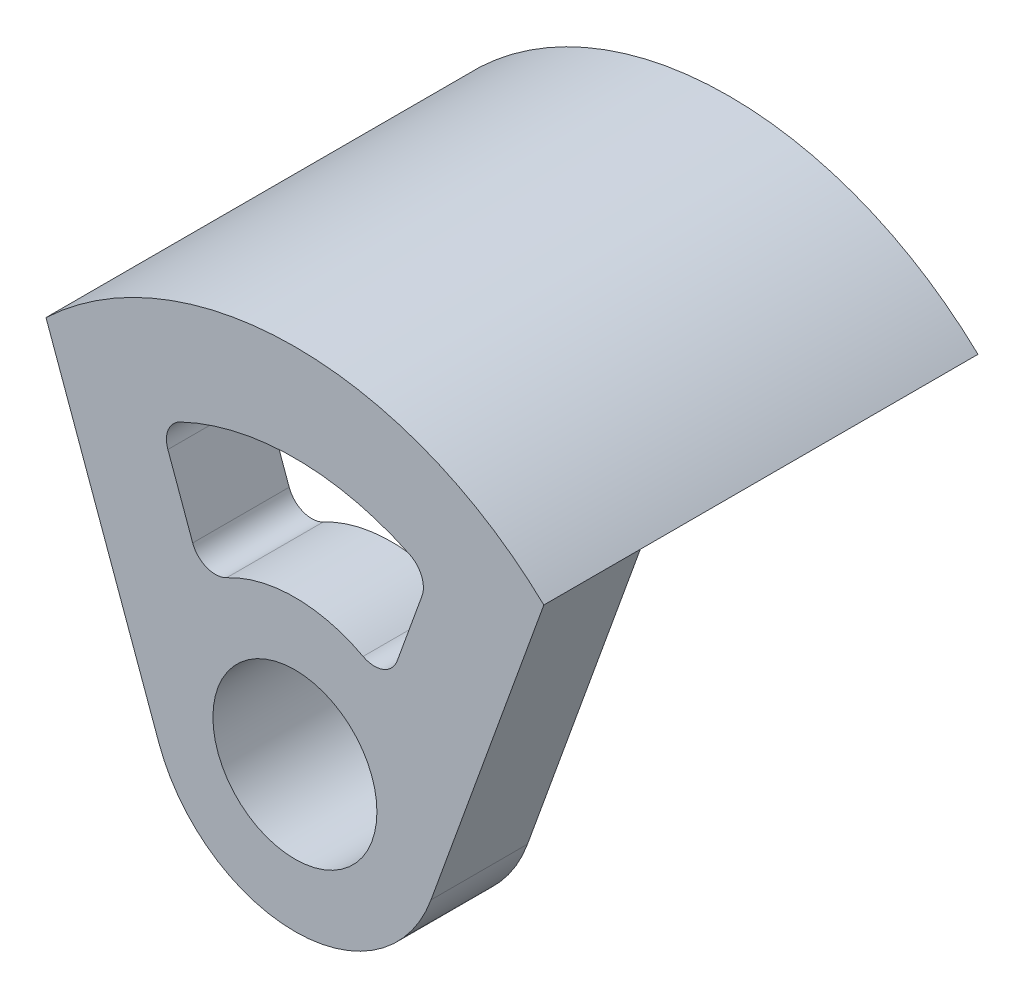
ISO-10303-21;
HEADER;
FILE_DESCRIPTION(('STEP AP214'),'2;1');
FILE_NAME('part.step','',(''),(''),'','','');
FILE_SCHEMA(('AUTOMOTIVE_DESIGN { 1 0 10303 214 1 1 1 1 }'));
ENDSEC;
DATA;
#1=APPLICATION_CONTEXT('core data for automotive mechanical design processes');
#2=APPLICATION_PROTOCOL_DEFINITION('international standard','automotive_design',2000,#1);
#3=PRODUCT_CONTEXT('',#1,'mechanical');
#4=PRODUCT('Part','Part','',(#3));
#5=PRODUCT_RELATED_PRODUCT_CATEGORY('part','',(#4));
#6=PRODUCT_DEFINITION_FORMATION('','',#4);
#7=PRODUCT_DEFINITION_CONTEXT('part definition',#1,'design');
#8=PRODUCT_DEFINITION('design','',#6,#7);
#9=PRODUCT_DEFINITION_SHAPE('','',#8);
#10=(LENGTH_UNIT() NAMED_UNIT(*) SI_UNIT(.MILLI.,.METRE.));
#11=(NAMED_UNIT(*) PLANE_ANGLE_UNIT() SI_UNIT($,.RADIAN.));
#12=(NAMED_UNIT(*) SI_UNIT($,.STERADIAN.) SOLID_ANGLE_UNIT());
#13=UNCERTAINTY_MEASURE_WITH_UNIT(LENGTH_MEASURE(1.E-05),#10,'distance_accuracy_value','');
#14=(GEOMETRIC_REPRESENTATION_CONTEXT(3) GLOBAL_UNCERTAINTY_ASSIGNED_CONTEXT((#13)) GLOBAL_UNIT_ASSIGNED_CONTEXT((#10,
#11,#12)) REPRESENTATION_CONTEXT('',''));
#15=CARTESIAN_POINT('',(0.,0.,0.));
#16=DIRECTION('',(0.,0.,1.));
#17=DIRECTION('',(1.,0.,0.));
#18=AXIS2_PLACEMENT_3D('',#15,#16,#17);
#19=CARTESIAN_POINT('',(0.,0.,-2.));
#20=DIRECTION('',(0.,0.,-1.));
#21=DIRECTION('',(-1.,0.,0.));
#22=AXIS2_PLACEMENT_3D('',#19,#20,#21);
#23=PLANE('',#22);
#24=DIRECTION('',(0.707106781186548,0.707106781186547,0.));
#25=VECTOR('',#24,1.);
#26=CARTESIAN_POINT('',(-0.141421356237321,0.141421356237321,-2.));
#27=LINE('',#26,#25);
#28=CARTESIAN_POINT('',(4.59408284078331,4.87692555325795,-2.));
#29=VERTEX_POINT('',#28);
#30=CARTESIAN_POINT('',(5.15999354923839,5.44283626171302,-2.));
#31=VERTEX_POINT('',#30);
#32=EDGE_CURVE('E211',#29,#31,#27,.T.);
#33=ORIENTED_EDGE('',*,*,#32,.F.);
#34=CARTESIAN_POINT('',(0.,0.,-2.));
#35=DIRECTION('',(0.,0.,-1.));
#36=DIRECTION('',(-1.,0.,0.));
#37=AXIS2_PLACEMENT_3D('',#34,#35,#36);
#38=CIRCLE('',#37,6.7);
#39=CARTESIAN_POINT('',(-4.59408284078335,4.87692555325792,-2.));
#40=VERTEX_POINT('',#39);
#41=EDGE_CURVE('E210',#29,#40,#38,.F.);
#42=ORIENTED_EDGE('',*,*,#41,.T.);
#43=DIRECTION('',(-0.707106781186551,0.707106781186544,0.));
#44=VECTOR('',#43,1.);
#45=CARTESIAN_POINT('',(0.141421356237305,0.141421356237306,-2.));
#46=LINE('',#45,#44);
#47=CARTESIAN_POINT('',(-5.15999354923843,5.44283626171299,-2.));
#48=VERTEX_POINT('',#47);
#49=EDGE_CURVE('E215',#40,#48,#46,.T.);
#50=ORIENTED_EDGE('',*,*,#49,.T.);
#51=CARTESIAN_POINT('',(0.,0.,-2.));
#52=DIRECTION('',(0.,0.,-1.));
#53=DIRECTION('',(-1.,0.,0.));
#54=AXIS2_PLACEMENT_3D('',#51,#52,#53);
#55=CIRCLE('',#54,7.5);
#56=EDGE_CURVE('E218',#31,#48,#55,.F.);
#57=ORIENTED_EDGE('',*,*,#56,.F.);
#58=EDGE_LOOP('',(#33,#42,#50,#57));
#59=FACE_BOUND('',#58,.T.);
#60=ADVANCED_FACE('F35',(#59),#23,.T.);
#61=CARTESIAN_POINT('',(-0.141421356237321,0.141421356237321,-12.6481290969766));
#62=DIRECTION('',(0.707106781186547,-0.707106781186548,0.));
#63=DIRECTION('',(0.707106781186548,0.707106781186547,0.));
#64=AXIS2_PLACEMENT_3D('',#61,#62,#63);
#65=PLANE('',#64);
#66=DIRECTION('',(0.,0.,1.));
#67=VECTOR('',#66,1.);
#68=CARTESIAN_POINT('',(4.59408284078331,4.87692555325795,-12.6481290969766));
#69=LINE('',#68,#67);
#70=CARTESIAN_POINT('',(4.59408284078331,4.87692555325795,5.));
#71=VERTEX_POINT('',#70);
#72=EDGE_CURVE('E225',#29,#71,#69,.T.);
#73=ORIENTED_EDGE('',*,*,#72,.F.);
#74=ORIENTED_EDGE('',*,*,#32,.T.);
#75=DIRECTION('',(0.,0.,1.));
#76=VECTOR('',#75,1.);
#77=CARTESIAN_POINT('',(5.15999354923839,5.44283626171302,-12.6481290969766));
#78=LINE('',#77,#76);
#79=CARTESIAN_POINT('',(5.15999354923839,5.44283626171302,5.));
#80=VERTEX_POINT('',#79);
#81=EDGE_CURVE('E214',#31,#80,#78,.T.);
#82=ORIENTED_EDGE('',*,*,#81,.T.);
#83=DIRECTION('',(0.707106781186548,0.707106781186547,0.));
#84=VECTOR('',#83,1.);
#85=CARTESIAN_POINT('',(-0.141421356237321,0.141421356237321,5.));
#86=LINE('',#85,#84);
#87=EDGE_CURVE('E205',#71,#80,#86,.T.);
#88=ORIENTED_EDGE('',*,*,#87,.F.);
#89=EDGE_LOOP('',(#73,#74,#82,#88));
#90=FACE_BOUND('',#89,.T.);
#91=ADVANCED_FACE('F324',(#90),#65,.T.);
#92=CARTESIAN_POINT('',(0.,0.,-12.6481290969766));
#93=DIRECTION('',(0.,0.,1.));
#94=DIRECTION('',(1.,0.,0.));
#95=AXIS2_PLACEMENT_3D('',#92,#93,#94);
#96=CYLINDRICAL_SURFACE('',#95,7.5);
#97=ORIENTED_EDGE('',*,*,#81,.F.);
#98=ORIENTED_EDGE('',*,*,#56,.T.);
#99=DIRECTION('',(0.,0.,1.));
#100=VECTOR('',#99,1.);
#101=CARTESIAN_POINT('',(-5.15999354923843,5.44283626171299,-12.6481290969766));
#102=LINE('',#101,#100);
#103=CARTESIAN_POINT('',(-5.15999354923843,5.44283626171299,5.));
#104=VERTEX_POINT('',#103);
#105=EDGE_CURVE('E221',#48,#104,#102,.T.);
#106=ORIENTED_EDGE('',*,*,#105,.T.);
#107=DIRECTION('',(0.,0.,-1.));
#108=VECTOR('',#107,1.);
#109=CARTESIAN_POINT('',(-5.15999354923843,5.44283626171299,7.));
#110=LINE('',#109,#108);
#111=CARTESIAN_POINT('',(-5.15999354923843,5.44283626171299,7.));
#112=VERTEX_POINT('',#111);
#113=EDGE_CURVE('E154',#112,#104,#110,.T.);
#114=ORIENTED_EDGE('',*,*,#113,.F.);
#115=CARTESIAN_POINT('',(0.,0.,7.));
#116=DIRECTION('',(0.,0.,1.));
#117=DIRECTION('',(1.,0.,0.));
#118=AXIS2_PLACEMENT_3D('',#115,#116,#117);
#119=CIRCLE('',#118,7.5);
#120=CARTESIAN_POINT('',(5.15999354923839,5.44283626171302,7.));
#121=VERTEX_POINT('',#120);
#122=EDGE_CURVE('E158',#121,#112,#119,.T.);
#123=ORIENTED_EDGE('',*,*,#122,.F.);
#124=DIRECTION('',(0.,0.,-1.));
#125=VECTOR('',#124,1.);
#126=CARTESIAN_POINT('',(5.15999354923839,5.44283626171302,7.));
#127=LINE('',#126,#125);
#128=EDGE_CURVE('E143',#121,#80,#127,.T.);
#129=ORIENTED_EDGE('',*,*,#128,.T.);
#130=EDGE_LOOP('',(#97,#98,#106,#114,#123,#129));
#131=FACE_BOUND('',#130,.T.);
#132=ADVANCED_FACE('F159',(#131),#96,.T.);
#133=CARTESIAN_POINT('',(0.141421356237305,0.141421356237306,-12.6481290969766));
#134=DIRECTION('',(0.707106781186544,0.707106781186551,0.));
#135=DIRECTION('',(-0.707106781186551,0.707106781186544,0.));
#136=AXIS2_PLACEMENT_3D('',#133,#134,#135);
#137=PLANE('',#136);
#138=ORIENTED_EDGE('',*,*,#49,.F.);
#139=DIRECTION('',(0.,0.,1.));
#140=VECTOR('',#139,1.);
#141=CARTESIAN_POINT('',(-4.59408284078335,4.87692555325791,-12.6481290969766));
#142=LINE('',#141,#140);
#143=CARTESIAN_POINT('',(-4.59408284078335,4.87692555325791,5.));
#144=VERTEX_POINT('',#143);
#145=EDGE_CURVE('E222',#40,#144,#142,.T.);
#146=ORIENTED_EDGE('',*,*,#145,.T.);
#147=DIRECTION('',(-0.707106781186551,0.707106781186544,0.));
#148=VECTOR('',#147,1.);
#149=CARTESIAN_POINT('',(0.141421356237305,0.141421356237306,5.));
#150=LINE('',#149,#148);
#151=EDGE_CURVE('E207',#144,#104,#150,.T.);
#152=ORIENTED_EDGE('',*,*,#151,.T.);
#153=ORIENTED_EDGE('',*,*,#105,.F.);
#154=EDGE_LOOP('',(#138,#146,#152,#153));
#155=FACE_BOUND('',#154,.T.);
#156=ADVANCED_FACE('F465',(#155),#137,.F.);
#157=CARTESIAN_POINT('',(0.,0.,-12.6481290969766));
#158=DIRECTION('',(0.,0.,1.));
#159=DIRECTION('',(1.,0.,0.));
#160=AXIS2_PLACEMENT_3D('',#157,#158,#159);
#161=CYLINDRICAL_SURFACE('',#160,6.7);
#162=ORIENTED_EDGE('',*,*,#41,.F.);
#163=ORIENTED_EDGE('',*,*,#72,.T.);
#164=CARTESIAN_POINT('',(0.,0.,5.));
#165=DIRECTION('',(0.,0.,1.));
#166=DIRECTION('',(1.,0.,0.));
#167=AXIS2_PLACEMENT_3D('',#164,#165,#166);
#168=CIRCLE('',#167,6.7);
#169=EDGE_CURVE('E153',#71,#144,#168,.T.);
#170=ORIENTED_EDGE('',*,*,#169,.T.);
#171=ORIENTED_EDGE('',*,*,#145,.F.);
#172=EDGE_LOOP('',(#162,#163,#170,#171));
#173=FACE_BOUND('',#172,.T.);
#174=ADVANCED_FACE('F419',(#173),#161,.F.);
#175=CARTESIAN_POINT('',(0.,0.,5.));
#176=DIRECTION('',(0.,0.,1.));
#177=DIRECTION('',(1.,0.,0.));
#178=AXIS2_PLACEMENT_3D('',#175,#176,#177);
#179=PLANE('',#178);
#180=CARTESIAN_POINT('',(0.,0.,5.));
#181=DIRECTION('',(0.,0.,1.));
#182=DIRECTION('',(1.,0.,0.));
#183=AXIS2_PLACEMENT_3D('',#180,#181,#182);
#184=CIRCLE('',#183,2.7);
#185=CARTESIAN_POINT('',(2.7,0.,5.));
#186=VERTEX_POINT('',#185);
#187=EDGE_CURVE('E230',#186,#186,#184,.T.);
#188=ORIENTED_EDGE('',*,*,#187,.T.);
#189=EDGE_LOOP('',(#188));
#190=FACE_BOUND('',#189,.T.);
#191=DIRECTION('',(-0.340277026705139,-0.940325233680725,0.));
#192=VECTOR('',#191,1.);
#193=CARTESIAN_POINT('',(0.940325233680727,-0.340277026705139,5.));
#194=LINE('',#193,#192);
#195=CARTESIAN_POINT('',(2.63318206721876,4.3377819448282,5.));
#196=VERTEX_POINT('',#195);
#197=CARTESIAN_POINT('',(2.11907943148427,2.91710513404305,5.));
#198=VERTEX_POINT('',#197);
#199=EDGE_CURVE('E180',#196,#198,#194,.T.);
#200=ORIENTED_EDGE('',*,*,#199,.F.);
#201=CARTESIAN_POINT('',(2.1630194503784,4.50792045818077,5.));
#202=DIRECTION('',(0.,0.,1.));
#203=DIRECTION('',(1.,0.,0.));
#204=AXIS2_PLACEMENT_3D('',#201,#202,#203);
#205=CIRCLE('',#204,0.5);
#206=CARTESIAN_POINT('',(2.37932139541624,4.95871250399885,5.));
#207=VERTEX_POINT('',#206);
#208=EDGE_CURVE('E260',#196,#207,#205,.T.);
#209=ORIENTED_EDGE('',*,*,#208,.T.);
#210=CARTESIAN_POINT('',(0.,0.,5.));
#211=DIRECTION('',(0.,0.,1.));
#212=DIRECTION('',(1.,0.,0.));
#213=AXIS2_PLACEMENT_3D('',#210,#211,#212);
#214=CIRCLE('',#213,5.5);
#215=CARTESIAN_POINT('',(-2.37932139541627,4.95871250399883,5.));
#216=VERTEX_POINT('',#215);
#217=EDGE_CURVE('E191',#207,#216,#214,.T.);
#218=ORIENTED_EDGE('',*,*,#217,.T.);
#219=CARTESIAN_POINT('',(-2.16301945037843,4.50792045818076,5.));
#220=DIRECTION('',(0.,0.,1.));
#221=DIRECTION('',(1.,0.,0.));
#222=AXIS2_PLACEMENT_3D('',#219,#220,#221);
#223=CIRCLE('',#222,0.5);
#224=CARTESIAN_POINT('',(-2.63318206721879,4.33778194482819,5.));
#225=VERTEX_POINT('',#224);
#226=EDGE_CURVE('E43',#216,#225,#223,.T.);
#227=ORIENTED_EDGE('',*,*,#226,.T.);
#228=DIRECTION('',(0.340277026705145,-0.940325233680723,0.));
#229=VECTOR('',#228,1.);
#230=CARTESIAN_POINT('',(-0.940325233680723,-0.340277026705145,5.));
#231=LINE('',#230,#229);
#232=CARTESIAN_POINT('',(-2.11907943148429,2.91710513404303,5.));
#233=VERTEX_POINT('',#232);
#234=EDGE_CURVE('E187',#225,#233,#231,.T.);
#235=ORIENTED_EDGE('',*,*,#234,.T.);
#236=CARTESIAN_POINT('',(-1.64891681464393,3.08724364739561,5.));
#237=DIRECTION('',(0.,0.,1.));
#238=DIRECTION('',(1.,0.,0.));
#239=AXIS2_PLACEMENT_3D('',#236,#237,#238);
#240=CIRCLE('',#239,0.5);
#241=CARTESIAN_POINT('',(-1.4133572696948,2.6462088406248,5.));
#242=VERTEX_POINT('',#241);
#243=EDGE_CURVE('E256',#233,#242,#240,.T.);
#244=ORIENTED_EDGE('',*,*,#243,.T.);
#245=CARTESIAN_POINT('',(0.,0.,5.));
#246=DIRECTION('',(0.,0.,1.));
#247=DIRECTION('',(1.,0.,0.));
#248=AXIS2_PLACEMENT_3D('',#245,#246,#247);
#249=CIRCLE('',#248,3.);
#250=CARTESIAN_POINT('',(1.41335726969478,2.64620884062481,5.));
#251=VERTEX_POINT('',#250);
#252=EDGE_CURVE('E183',#251,#242,#249,.T.);
#253=ORIENTED_EDGE('',*,*,#252,.F.);
#254=CARTESIAN_POINT('',(1.64891681464391,3.08724364739562,5.));
#255=DIRECTION('',(0.,0.,1.));
#256=DIRECTION('',(1.,0.,0.));
#257=AXIS2_PLACEMENT_3D('',#254,#255,#256);
#258=CIRCLE('',#257,0.5);
#259=EDGE_CURVE('E252',#251,#198,#258,.T.);
#260=ORIENTED_EDGE('',*,*,#259,.T.);
#261=EDGE_LOOP('',(#200,#209,#218,#227,#235,#244,#253,#260));
#262=FACE_BOUND('',#261,.T.);
#263=ORIENTED_EDGE('',*,*,#169,.F.);
#264=ORIENTED_EDGE('',*,*,#87,.T.);
#265=DIRECTION('',(-0.340277026705139,-0.940325233680725,0.));
#266=VECTOR('',#265,1.);
#267=CARTESIAN_POINT('',(2.82097570104218,-1.02083108011542,5.));
#268=LINE('',#267,#266);
#269=CARTESIAN_POINT('',(2.82097570104218,-1.02083108011542,5.));
#270=VERTEX_POINT('',#269);
#271=EDGE_CURVE('E149',#80,#270,#268,.T.);
#272=ORIENTED_EDGE('',*,*,#271,.T.);
#273=CARTESIAN_POINT('',(-2.82097570104217,-1.02083108011544,5.));
#274=VERTEX_POINT('',#273);
#275=EDGE_CURVE('E188',#274,#270,#249,.T.);
#276=ORIENTED_EDGE('',*,*,#275,.F.);
#277=DIRECTION('',(0.340277026705146,-0.940325233680723,0.));
#278=VECTOR('',#277,1.);
#279=CARTESIAN_POINT('',(-2.82097570104217,-1.02083108011544,5.));
#280=LINE('',#279,#278);
#281=EDGE_CURVE('E195',#104,#274,#280,.T.);
#282=ORIENTED_EDGE('',*,*,#281,.F.);
#283=ORIENTED_EDGE('',*,*,#151,.F.);
#284=EDGE_LOOP('',(#263,#264,#272,#276,#282,#283));
#285=FACE_BOUND('',#284,.T.);
#286=ADVANCED_FACE('F266',(#190,#262,#285),#179,.F.);
#287=CARTESIAN_POINT('',(2.82097570104218,-1.02083108011542,7.));
#288=DIRECTION('',(0.940325233680725,-0.340277026705139,0.));
#289=DIRECTION('',(0.340277026705139,0.940325233680725,0.));
#290=AXIS2_PLACEMENT_3D('',#287,#288,#289);
#291=PLANE('',#290);
#292=ORIENTED_EDGE('',*,*,#271,.F.);
#293=ORIENTED_EDGE('',*,*,#128,.F.);
#294=DIRECTION('',(-0.340277026705139,-0.940325233680725,0.));
#295=VECTOR('',#294,1.);
#296=CARTESIAN_POINT('',(2.82097570104218,-1.02083108011542,7.));
#297=LINE('',#296,#295);
#298=CARTESIAN_POINT('',(2.82097570104218,-1.02083108011542,7.));
#299=VERTEX_POINT('',#298);
#300=EDGE_CURVE('E147',#121,#299,#297,.T.);
#301=ORIENTED_EDGE('',*,*,#300,.T.);
#302=DIRECTION('',(0.,0.,-1.));
#303=VECTOR('',#302,1.);
#304=CARTESIAN_POINT('',(2.82097570104218,-1.02083108011542,7.));
#305=LINE('',#304,#303);
#306=EDGE_CURVE('E179',#299,#270,#305,.T.);
#307=ORIENTED_EDGE('',*,*,#306,.T.);
#308=EDGE_LOOP('',(#292,#293,#301,#307));
#309=FACE_BOUND('',#308,.T.);
#310=ADVANCED_FACE('F145',(#309),#291,.T.);
#311=CARTESIAN_POINT('',(-2.82097570104217,-1.02083108011544,7.));
#312=DIRECTION('',(0.940325233680723,0.340277026705146,0.));
#313=DIRECTION('',(-0.340277026705146,0.940325233680723,0.));
#314=AXIS2_PLACEMENT_3D('',#311,#312,#313);
#315=PLANE('',#314);
#316=ORIENTED_EDGE('',*,*,#281,.T.);
#317=DIRECTION('',(0.,0.,-1.));
#318=VECTOR('',#317,1.);
#319=CARTESIAN_POINT('',(-2.82097570104217,-1.02083108011544,7.));
#320=LINE('',#319,#318);
#321=CARTESIAN_POINT('',(-2.82097570104217,-1.02083108011544,7.));
#322=VERTEX_POINT('',#321);
#323=EDGE_CURVE('E199',#322,#274,#320,.T.);
#324=ORIENTED_EDGE('',*,*,#323,.F.);
#325=DIRECTION('',(0.340277026705146,-0.940325233680723,0.));
#326=VECTOR('',#325,1.);
#327=CARTESIAN_POINT('',(-2.82097570104217,-1.02083108011544,7.));
#328=LINE('',#327,#326);
#329=EDGE_CURVE('E163',#112,#322,#328,.T.);
#330=ORIENTED_EDGE('',*,*,#329,.F.);
#331=ORIENTED_EDGE('',*,*,#113,.T.);
#332=EDGE_LOOP('',(#316,#324,#330,#331));
#333=FACE_BOUND('',#332,.T.);
#334=ADVANCED_FACE('F408',(#333),#315,.F.);
#335=CARTESIAN_POINT('',(0.940325233680727,-0.340277026705139,7.));
#336=DIRECTION('',(0.940325233680725,-0.340277026705139,0.));
#337=DIRECTION('',(0.340277026705139,0.940325233680725,0.));
#338=AXIS2_PLACEMENT_3D('',#335,#336,#337);
#339=PLANE('',#338);
#340=ORIENTED_EDGE('',*,*,#199,.T.);
#341=DIRECTION('',(0.,0.,1.));
#342=VECTOR('',#341,1.);
#343=CARTESIAN_POINT('',(2.11907943148427,2.91710513404305,7.));
#344=LINE('',#343,#342);
#345=CARTESIAN_POINT('',(2.11907943148427,2.91710513404305,7.));
#346=VERTEX_POINT('',#345);
#347=EDGE_CURVE('E241',#198,#346,#344,.T.);
#348=ORIENTED_EDGE('',*,*,#347,.T.);
#349=DIRECTION('',(-0.340277026705139,-0.940325233680725,0.));
#350=VECTOR('',#349,1.);
#351=CARTESIAN_POINT('',(0.940325233680727,-0.340277026705139,7.));
#352=LINE('',#351,#350);
#353=CARTESIAN_POINT('',(2.63318206721876,4.3377819448282,7.));
#354=VERTEX_POINT('',#353);
#355=EDGE_CURVE('E285',#354,#346,#352,.T.);
#356=ORIENTED_EDGE('',*,*,#355,.F.);
#357=DIRECTION('',(0.,0.,-1.));
#358=VECTOR('',#357,1.);
#359=CARTESIAN_POINT('',(2.63318206721876,4.3377819448282,7.));
#360=LINE('',#359,#358);
#361=EDGE_CURVE('E238',#354,#196,#360,.T.);
#362=ORIENTED_EDGE('',*,*,#361,.T.);
#363=EDGE_LOOP('',(#340,#348,#356,#362));
#364=FACE_BOUND('',#363,.T.);
#365=ADVANCED_FACE('F283',(#364),#339,.F.);
#366=CARTESIAN_POINT('',(0.,0.,7.));
#367=DIRECTION('',(0.,0.,-1.));
#368=DIRECTION('',(-1.,0.,0.));
#369=AXIS2_PLACEMENT_3D('',#366,#367,#368);
#370=CYLINDRICAL_SURFACE('',#369,3.);
#371=CARTESIAN_POINT('',(0.,0.,7.));
#372=DIRECTION('',(0.,0.,1.));
#373=DIRECTION('',(1.,0.,0.));
#374=AXIS2_PLACEMENT_3D('',#371,#372,#373);
#375=CIRCLE('',#374,3.);
#376=CARTESIAN_POINT('',(1.41335726969478,2.64620884062481,7.));
#377=VERTEX_POINT('',#376);
#378=CARTESIAN_POINT('',(-1.4133572696948,2.6462088406248,7.));
#379=VERTEX_POINT('',#378);
#380=EDGE_CURVE('E296',#377,#379,#375,.T.);
#381=ORIENTED_EDGE('',*,*,#380,.F.);
#382=DIRECTION('',(0.,0.,-1.));
#383=VECTOR('',#382,1.);
#384=CARTESIAN_POINT('',(1.41335726969478,2.64620884062481,7.));
#385=LINE('',#384,#383);
#386=EDGE_CURVE('E235',#377,#251,#385,.T.);
#387=ORIENTED_EDGE('',*,*,#386,.T.);
#388=ORIENTED_EDGE('',*,*,#252,.T.);
#389=DIRECTION('',(0.,0.,-1.));
#390=VECTOR('',#389,1.);
#391=CARTESIAN_POINT('',(-1.4133572696948,2.6462088406248,7.));
#392=LINE('',#391,#390);
#393=EDGE_CURVE('E233',#242,#379,#392,.F.);
#394=ORIENTED_EDGE('',*,*,#393,.T.);
#395=EDGE_LOOP('',(#381,#387,#388,#394));
#396=FACE_BOUND('',#395,.T.);
#397=ADVANCED_FACE('F293',(#396),#370,.T.);
#398=CARTESIAN_POINT('',(-0.940325233680723,-0.340277026705145,7.));
#399=DIRECTION('',(0.940325233680723,0.340277026705145,0.));
#400=DIRECTION('',(-0.340277026705145,0.940325233680723,0.));
#401=AXIS2_PLACEMENT_3D('',#398,#399,#400);
#402=PLANE('',#401);
#403=DIRECTION('',(0.340277026705145,-0.940325233680723,0.));
#404=VECTOR('',#403,1.);
#405=CARTESIAN_POINT('',(-0.940325233680723,-0.340277026705145,7.));
#406=LINE('',#405,#404);
#407=CARTESIAN_POINT('',(-2.63318206721879,4.33778194482819,7.));
#408=VERTEX_POINT('',#407);
#409=CARTESIAN_POINT('',(-2.11907943148429,2.91710513404303,7.));
#410=VERTEX_POINT('',#409);
#411=EDGE_CURVE('E171',#408,#410,#406,.T.);
#412=ORIENTED_EDGE('',*,*,#411,.T.);
#413=DIRECTION('',(0.,0.,-1.));
#414=VECTOR('',#413,1.);
#415=CARTESIAN_POINT('',(-2.11907943148429,2.91710513404303,7.));
#416=LINE('',#415,#414);
#417=EDGE_CURVE('E245',#410,#233,#416,.T.);
#418=ORIENTED_EDGE('',*,*,#417,.T.);
#419=ORIENTED_EDGE('',*,*,#234,.F.);
#420=DIRECTION('',(0.,0.,1.));
#421=VECTOR('',#420,1.);
#422=CARTESIAN_POINT('',(-2.63318206721879,4.33778194482818,7.));
#423=LINE('',#422,#421);
#424=EDGE_CURVE('E243',#225,#408,#423,.T.);
#425=ORIENTED_EDGE('',*,*,#424,.T.);
#426=EDGE_LOOP('',(#412,#418,#419,#425));
#427=FACE_BOUND('',#426,.T.);
#428=ADVANCED_FACE('F273',(#427),#402,.T.);
#429=ORIENTED_EDGE('',*,*,#275,.T.);
#430=ORIENTED_EDGE('',*,*,#306,.F.);
#431=EDGE_CURVE('E167',#322,#299,#375,.T.);
#432=ORIENTED_EDGE('',*,*,#431,.F.);
#433=ORIENTED_EDGE('',*,*,#323,.T.);
#434=EDGE_LOOP('',(#429,#430,#432,#433));
#435=FACE_BOUND('',#434,.T.);
#436=ADVANCED_FACE('F319',(#435),#370,.T.);
#437=CARTESIAN_POINT('',(0.,0.,7.));
#438=DIRECTION('',(0.,0.,-1.));
#439=DIRECTION('',(-1.,0.,0.));
#440=AXIS2_PLACEMENT_3D('',#437,#438,#439);
#441=CYLINDRICAL_SURFACE('',#440,5.5);
#442=ORIENTED_EDGE('',*,*,#217,.F.);
#443=DIRECTION('',(0.,0.,-1.));
#444=VECTOR('',#443,1.);
#445=CARTESIAN_POINT('',(2.37932139541624,4.95871250399885,7.));
#446=LINE('',#445,#444);
#447=CARTESIAN_POINT('',(2.37932139541624,4.95871250399885,7.));
#448=VERTEX_POINT('',#447);
#449=EDGE_CURVE('E55',#207,#448,#446,.F.);
#450=ORIENTED_EDGE('',*,*,#449,.T.);
#451=CARTESIAN_POINT('',(0.,0.,7.));
#452=DIRECTION('',(0.,0.,1.));
#453=DIRECTION('',(1.,0.,0.));
#454=AXIS2_PLACEMENT_3D('',#451,#452,#453);
#455=CIRCLE('',#454,5.5);
#456=CARTESIAN_POINT('',(-2.37932139541627,4.95871250399883,7.));
#457=VERTEX_POINT('',#456);
#458=EDGE_CURVE('E169',#448,#457,#455,.T.);
#459=ORIENTED_EDGE('',*,*,#458,.T.);
#460=DIRECTION('',(0.,0.,-1.));
#461=VECTOR('',#460,1.);
#462=CARTESIAN_POINT('',(-2.37932139541627,4.95871250399883,7.));
#463=LINE('',#462,#461);
#464=EDGE_CURVE('E248',#457,#216,#463,.T.);
#465=ORIENTED_EDGE('',*,*,#464,.T.);
#466=EDGE_LOOP('',(#442,#450,#459,#465));
#467=FACE_BOUND('',#466,.T.);
#468=ADVANCED_FACE('F275',(#467),#441,.F.);
#469=CARTESIAN_POINT('',(0.,0.,7.));
#470=DIRECTION('',(0.,0.,-1.));
#471=DIRECTION('',(-1.,0.,0.));
#472=AXIS2_PLACEMENT_3D('',#469,#470,#471);
#473=CYLINDRICAL_SURFACE('',#472,1.7);
#474=CARTESIAN_POINT('',(0.,0.,7.));
#475=DIRECTION('',(0.,0.,1.));
#476=DIRECTION('',(1.,0.,0.));
#477=AXIS2_PLACEMENT_3D('',#474,#475,#476);
#478=CIRCLE('',#477,1.7);
#479=CARTESIAN_POINT('',(1.7,0.,7.));
#480=VERTEX_POINT('',#479);
#481=EDGE_CURVE('E176',#480,#480,#478,.T.);
#482=ORIENTED_EDGE('',*,*,#481,.T.);
#483=EDGE_LOOP('',(#482));
#484=FACE_BOUND('',#483,.T.);
#485=CARTESIAN_POINT('',(0.,0.,4.5));
#486=DIRECTION('',(0.,0.,-1.));
#487=DIRECTION('',(-1.,0.,0.));
#488=AXIS2_PLACEMENT_3D('',#485,#486,#487);
#489=CIRCLE('',#488,1.7);
#490=CARTESIAN_POINT('',(-1.7,0.,4.5));
#491=VERTEX_POINT('',#490);
#492=EDGE_CURVE('E303',#491,#491,#489,.F.);
#493=ORIENTED_EDGE('',*,*,#492,.F.);
#494=EDGE_LOOP('',(#493));
#495=FACE_BOUND('',#494,.T.);
#496=ADVANCED_FACE('F310',(#484,#495),#473,.F.);
#497=CARTESIAN_POINT('',(0.,0.,7.));
#498=DIRECTION('',(0.,0.,1.));
#499=DIRECTION('',(1.,0.,0.));
#500=AXIS2_PLACEMENT_3D('',#497,#498,#499);
#501=PLANE('',#500);
#502=ORIENTED_EDGE('',*,*,#458,.F.);
#503=CARTESIAN_POINT('',(2.1630194503784,4.50792045818077,7.));
#504=DIRECTION('',(0.,0.,1.));
#505=DIRECTION('',(1.,0.,0.));
#506=AXIS2_PLACEMENT_3D('',#503,#504,#505);
#507=CIRCLE('',#506,0.5);
#508=EDGE_CURVE('E262',#448,#354,#507,.F.);
#509=ORIENTED_EDGE('',*,*,#508,.T.);
#510=ORIENTED_EDGE('',*,*,#355,.T.);
#511=CARTESIAN_POINT('',(1.64891681464391,3.08724364739562,7.));
#512=DIRECTION('',(0.,0.,1.));
#513=DIRECTION('',(1.,0.,0.));
#514=AXIS2_PLACEMENT_3D('',#511,#512,#513);
#515=CIRCLE('',#514,0.5);
#516=EDGE_CURVE('E254',#346,#377,#515,.F.);
#517=ORIENTED_EDGE('',*,*,#516,.T.);
#518=ORIENTED_EDGE('',*,*,#380,.T.);
#519=CARTESIAN_POINT('',(-1.64891681464393,3.08724364739561,7.));
#520=DIRECTION('',(0.,0.,1.));
#521=DIRECTION('',(1.,0.,0.));
#522=AXIS2_PLACEMENT_3D('',#519,#520,#521);
#523=CIRCLE('',#522,0.5);
#524=EDGE_CURVE('E258',#379,#410,#523,.F.);
#525=ORIENTED_EDGE('',*,*,#524,.T.);
#526=ORIENTED_EDGE('',*,*,#411,.F.);
#527=CARTESIAN_POINT('',(-2.16301945037843,4.50792045818076,7.));
#528=DIRECTION('',(0.,0.,1.));
#529=DIRECTION('',(1.,0.,0.));
#530=AXIS2_PLACEMENT_3D('',#527,#528,#529);
#531=CIRCLE('',#530,0.5);
#532=EDGE_CURVE('E11',#408,#457,#531,.F.);
#533=ORIENTED_EDGE('',*,*,#532,.T.);
#534=EDGE_LOOP('',(#502,#509,#510,#517,#518,#525,#526,#533));
#535=FACE_BOUND('',#534,.T.);
#536=ORIENTED_EDGE('',*,*,#300,.F.);
#537=ORIENTED_EDGE('',*,*,#122,.T.);
#538=ORIENTED_EDGE('',*,*,#329,.T.);
#539=ORIENTED_EDGE('',*,*,#431,.T.);
#540=EDGE_LOOP('',(#536,#537,#538,#539));
#541=FACE_BOUND('',#540,.T.);
#542=ORIENTED_EDGE('',*,*,#481,.F.);
#543=EDGE_LOOP('',(#542));
#544=FACE_BOUND('',#543,.T.);
#545=ADVANCED_FACE('F165',(#535,#541,#544),#501,.T.);
#546=CARTESIAN_POINT('',(0.,0.,4.5));
#547=DIRECTION('',(0.,0.,-1.));
#548=DIRECTION('',(-1.,0.,0.));
#549=AXIS2_PLACEMENT_3D('',#546,#547,#548);
#550=PLANE('',#549);
#551=ORIENTED_EDGE('',*,*,#492,.T.);
#552=EDGE_LOOP('',(#551));
#553=FACE_BOUND('',#552,.T.);
#554=CARTESIAN_POINT('',(0.,0.,4.5));
#555=DIRECTION('',(0.,0.,-1.));
#556=DIRECTION('',(-1.,0.,0.));
#557=AXIS2_PLACEMENT_3D('',#554,#555,#556);
#558=CIRCLE('',#557,2.2);
#559=CARTESIAN_POINT('',(-2.2,0.,4.5));
#560=VERTEX_POINT('',#559);
#561=EDGE_CURVE('E184',#560,#560,#558,.T.);
#562=ORIENTED_EDGE('',*,*,#561,.T.);
#563=EDGE_LOOP('',(#562));
#564=FACE_BOUND('',#563,.T.);
#565=ADVANCED_FACE('F307',(#553,#564),#550,.T.);
#566=CARTESIAN_POINT('',(0.,0.,4.49999999999999));
#567=DIRECTION('',(0.,0.,1.));
#568=DIRECTION('',(1.,0.,0.));
#569=AXIS2_PLACEMENT_3D('',#566,#567,#568);
#570=CONICAL_SURFACE('',#569,2.2,0.785398163397444);
#571=ORIENTED_EDGE('',*,*,#187,.F.);
#572=EDGE_LOOP('',(#571));
#573=FACE_BOUND('',#572,.T.);
#574=ORIENTED_EDGE('',*,*,#561,.F.);
#575=EDGE_LOOP('',(#574));
#576=FACE_BOUND('',#575,.T.);
#577=ADVANCED_FACE('F334',(#573,#576),#570,.T.);
#578=CARTESIAN_POINT('',(1.64891681464391,3.08724364739562,7.));
#579=DIRECTION('',(0.,0.,-1.));
#580=DIRECTION('',(-1.,0.,0.));
#581=AXIS2_PLACEMENT_3D('',#578,#579,#580);
#582=CYLINDRICAL_SURFACE('',#581,0.5);
#583=ORIENTED_EDGE('',*,*,#516,.F.);
#584=ORIENTED_EDGE('',*,*,#347,.F.);
#585=ORIENTED_EDGE('',*,*,#259,.F.);
#586=ORIENTED_EDGE('',*,*,#386,.F.);
#587=EDGE_LOOP('',(#583,#584,#585,#586));
#588=FACE_BOUND('',#587,.T.);
#589=ADVANCED_FACE('F290',(#588),#582,.F.);
#590=CARTESIAN_POINT('',(-1.64891681464393,3.08724364739561,7.));
#591=DIRECTION('',(0.,0.,-1.));
#592=DIRECTION('',(-1.,0.,0.));
#593=AXIS2_PLACEMENT_3D('',#590,#591,#592);
#594=CYLINDRICAL_SURFACE('',#593,0.5);
#595=ORIENTED_EDGE('',*,*,#524,.F.);
#596=ORIENTED_EDGE('',*,*,#393,.F.);
#597=ORIENTED_EDGE('',*,*,#243,.F.);
#598=ORIENTED_EDGE('',*,*,#417,.F.);
#599=EDGE_LOOP('',(#595,#596,#597,#598));
#600=FACE_BOUND('',#599,.T.);
#601=ADVANCED_FACE('F340',(#600),#594,.F.);
#602=CARTESIAN_POINT('',(2.1630194503784,4.50792045818077,7.));
#603=DIRECTION('',(0.,0.,-1.));
#604=DIRECTION('',(-1.,0.,0.));
#605=AXIS2_PLACEMENT_3D('',#602,#603,#604);
#606=CYLINDRICAL_SURFACE('',#605,0.5);
#607=ORIENTED_EDGE('',*,*,#508,.F.);
#608=ORIENTED_EDGE('',*,*,#449,.F.);
#609=ORIENTED_EDGE('',*,*,#208,.F.);
#610=ORIENTED_EDGE('',*,*,#361,.F.);
#611=EDGE_LOOP('',(#607,#608,#609,#610));
#612=FACE_BOUND('',#611,.T.);
#613=ADVANCED_FACE('F281',(#612),#606,.F.);
#614=CARTESIAN_POINT('',(-2.16301945037843,4.50792045818076,7.));
#615=DIRECTION('',(0.,0.,-1.));
#616=DIRECTION('',(-1.,0.,0.));
#617=AXIS2_PLACEMENT_3D('',#614,#615,#616);
#618=CYLINDRICAL_SURFACE('',#617,0.5);
#619=ORIENTED_EDGE('',*,*,#532,.F.);
#620=ORIENTED_EDGE('',*,*,#424,.F.);
#621=ORIENTED_EDGE('',*,*,#226,.F.);
#622=ORIENTED_EDGE('',*,*,#464,.F.);
#623=EDGE_LOOP('',(#619,#620,#621,#622));
#624=FACE_BOUND('',#623,.T.);
#625=ADVANCED_FACE('F37',(#624),#618,.F.);
#626=CLOSED_SHELL('',(#60,#91,#132,#156,#174,#286,#310,#334,#365,#397,#428,#436,#468,#496,#545,
#565,#577,#589,#601,#613,#625));
#627=MANIFOLD_SOLID_BREP('B2',#626);
#628=ADVANCED_BREP_SHAPE_REPRESENTATION('',(#18,#627),#14);
#629=SHAPE_DEFINITION_REPRESENTATION(#9,#628);
ENDSEC;
END-ISO-10303-21;
